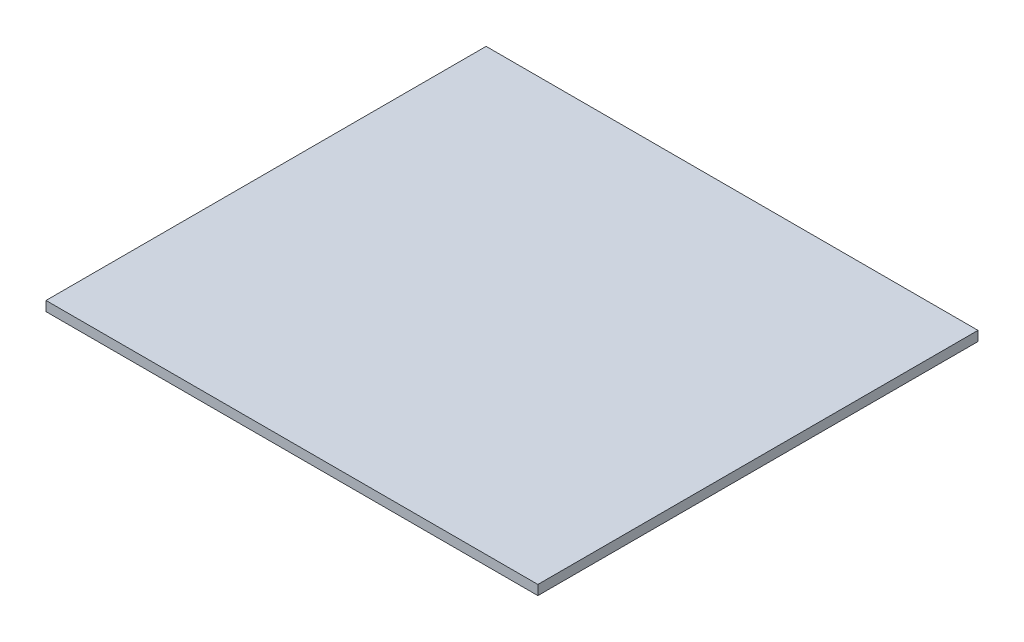
ISO-10303-21;
HEADER;
FILE_DESCRIPTION(('STEP AP214'),'2;1');
FILE_NAME('part.step','',(''),(''),'','','');
FILE_SCHEMA(('AUTOMOTIVE_DESIGN { 1 0 10303 214 1 1 1 1 }'));
ENDSEC;
DATA;
#1=APPLICATION_CONTEXT('core data for automotive mechanical design processes');
#2=APPLICATION_PROTOCOL_DEFINITION('international standard','automotive_design',2000,#1);
#3=PRODUCT_CONTEXT('',#1,'mechanical');
#4=PRODUCT('Part','Part','',(#3));
#5=PRODUCT_RELATED_PRODUCT_CATEGORY('part','',(#4));
#6=PRODUCT_DEFINITION_FORMATION('','',#4);
#7=PRODUCT_DEFINITION_CONTEXT('part definition',#1,'design');
#8=PRODUCT_DEFINITION('design','',#6,#7);
#9=PRODUCT_DEFINITION_SHAPE('','',#8);
#10=(LENGTH_UNIT() NAMED_UNIT(*) SI_UNIT(.MILLI.,.METRE.));
#11=(NAMED_UNIT(*) PLANE_ANGLE_UNIT() SI_UNIT($,.RADIAN.));
#12=(NAMED_UNIT(*) SI_UNIT($,.STERADIAN.) SOLID_ANGLE_UNIT());
#13=UNCERTAINTY_MEASURE_WITH_UNIT(LENGTH_MEASURE(1.E-05),#10,'distance_accuracy_value','');
#14=(GEOMETRIC_REPRESENTATION_CONTEXT(3) GLOBAL_UNCERTAINTY_ASSIGNED_CONTEXT((#13)) GLOBAL_UNIT_ASSIGNED_CONTEXT((#10,
#11,#12)) REPRESENTATION_CONTEXT('',''));
#15=CARTESIAN_POINT('',(0.,0.,0.));
#16=DIRECTION('',(0.,0.,1.));
#17=DIRECTION('',(1.,0.,0.));
#18=AXIS2_PLACEMENT_3D('',#15,#16,#17);
#19=CARTESIAN_POINT('',(0.,6.,0.));
#20=DIRECTION('',(1.,0.,0.));
#21=DIRECTION('',(0.,0.,-1.));
#22=AXIS2_PLACEMENT_3D('',#19,#20,#21);
#23=PLANE('',#22);
#24=DIRECTION('',(0.,0.,1.));
#25=VECTOR('',#24,1.);
#26=CARTESIAN_POINT('',(0.,0.,0.));
#27=LINE('',#26,#25);
#28=CARTESIAN_POINT('',(0.,0.,-272.));
#29=VERTEX_POINT('',#28);
#30=CARTESIAN_POINT('',(0.,0.,0.));
#31=VERTEX_POINT('',#30);
#32=EDGE_CURVE('E98',#29,#31,#27,.T.);
#33=ORIENTED_EDGE('',*,*,#32,.T.);
#34=DIRECTION('',(0.,-1.,0.));
#35=VECTOR('',#34,1.);
#36=CARTESIAN_POINT('',(0.,6.,0.));
#37=LINE('',#36,#35);
#38=CARTESIAN_POINT('',(0.,6.,0.));
#39=VERTEX_POINT('',#38);
#40=EDGE_CURVE('E11',#39,#31,#37,.T.);
#41=ORIENTED_EDGE('',*,*,#40,.F.);
#42=DIRECTION('',(0.,0.,1.));
#43=VECTOR('',#42,1.);
#44=CARTESIAN_POINT('',(0.,6.,0.));
#45=LINE('',#44,#43);
#46=CARTESIAN_POINT('',(0.,6.,-272.));
#47=VERTEX_POINT('',#46);
#48=EDGE_CURVE('E86',#47,#39,#45,.T.);
#49=ORIENTED_EDGE('',*,*,#48,.F.);
#50=DIRECTION('',(0.,-1.,0.));
#51=VECTOR('',#50,1.);
#52=CARTESIAN_POINT('',(0.,6.,-272.));
#53=LINE('',#52,#51);
#54=EDGE_CURVE('E94',#47,#29,#53,.T.);
#55=ORIENTED_EDGE('',*,*,#54,.T.);
#56=EDGE_LOOP('',(#33,#41,#49,#55));
#57=FACE_BOUND('',#56,.T.);
#58=ADVANCED_FACE('F35',(#57),#23,.F.);
#59=CARTESIAN_POINT('',(0.,6.,0.));
#60=DIRECTION('',(0.,0.,-1.));
#61=DIRECTION('',(-1.,0.,0.));
#62=AXIS2_PLACEMENT_3D('',#59,#60,#61);
#63=PLANE('',#62);
#64=DIRECTION('',(1.,0.,0.));
#65=VECTOR('',#64,1.);
#66=CARTESIAN_POINT('',(0.,0.,0.));
#67=LINE('',#66,#65);
#68=CARTESIAN_POINT('',(304.,0.,0.));
#69=VERTEX_POINT('',#68);
#70=EDGE_CURVE('E90',#31,#69,#67,.T.);
#71=ORIENTED_EDGE('',*,*,#70,.T.);
#72=DIRECTION('',(0.,-1.,0.));
#73=VECTOR('',#72,1.);
#74=CARTESIAN_POINT('',(304.,6.,0.));
#75=LINE('',#74,#73);
#76=CARTESIAN_POINT('',(304.,6.,0.));
#77=VERTEX_POINT('',#76);
#78=EDGE_CURVE('E43',#77,#69,#75,.T.);
#79=ORIENTED_EDGE('',*,*,#78,.F.);
#80=DIRECTION('',(1.,0.,0.));
#81=VECTOR('',#80,1.);
#82=CARTESIAN_POINT('',(0.,6.,0.));
#83=LINE('',#82,#81);
#84=EDGE_CURVE('E81',#39,#77,#83,.T.);
#85=ORIENTED_EDGE('',*,*,#84,.F.);
#86=ORIENTED_EDGE('',*,*,#40,.T.);
#87=EDGE_LOOP('',(#71,#79,#85,#86));
#88=FACE_BOUND('',#87,.T.);
#89=ADVANCED_FACE('F89',(#88),#63,.F.);
#90=CARTESIAN_POINT('',(304.,6.,0.));
#91=DIRECTION('',(-1.,0.,0.));
#92=DIRECTION('',(0.,0.,1.));
#93=AXIS2_PLACEMENT_3D('',#90,#91,#92);
#94=PLANE('',#93);
#95=DIRECTION('',(0.,0.,-1.));
#96=VECTOR('',#95,1.);
#97=CARTESIAN_POINT('',(304.,0.,0.));
#98=LINE('',#97,#96);
#99=CARTESIAN_POINT('',(304.,0.,-272.));
#100=VERTEX_POINT('',#99);
#101=EDGE_CURVE('E68',#69,#100,#98,.T.);
#102=ORIENTED_EDGE('',*,*,#101,.T.);
#103=DIRECTION('',(0.,-1.,0.));
#104=VECTOR('',#103,1.);
#105=CARTESIAN_POINT('',(304.,6.,-272.));
#106=LINE('',#105,#104);
#107=CARTESIAN_POINT('',(304.,6.,-272.));
#108=VERTEX_POINT('',#107);
#109=EDGE_CURVE('E91',#108,#100,#106,.T.);
#110=ORIENTED_EDGE('',*,*,#109,.F.);
#111=DIRECTION('',(0.,0.,-1.));
#112=VECTOR('',#111,1.);
#113=CARTESIAN_POINT('',(304.,6.,0.));
#114=LINE('',#113,#112);
#115=EDGE_CURVE('E84',#77,#108,#114,.T.);
#116=ORIENTED_EDGE('',*,*,#115,.F.);
#117=ORIENTED_EDGE('',*,*,#78,.T.);
#118=EDGE_LOOP('',(#102,#110,#116,#117));
#119=FACE_BOUND('',#118,.T.);
#120=ADVANCED_FACE('F92',(#119),#94,.F.);
#121=CARTESIAN_POINT('',(0.,6.,-272.));
#122=DIRECTION('',(0.,0.,1.));
#123=DIRECTION('',(1.,0.,0.));
#124=AXIS2_PLACEMENT_3D('',#121,#122,#123);
#125=PLANE('',#124);
#126=DIRECTION('',(-1.,0.,0.));
#127=VECTOR('',#126,1.);
#128=CARTESIAN_POINT('',(0.,0.,-272.));
#129=LINE('',#128,#127);
#130=EDGE_CURVE('E74',#100,#29,#129,.T.);
#131=ORIENTED_EDGE('',*,*,#130,.T.);
#132=ORIENTED_EDGE('',*,*,#54,.F.);
#133=DIRECTION('',(-1.,0.,0.));
#134=VECTOR('',#133,1.);
#135=CARTESIAN_POINT('',(0.,6.,-272.));
#136=LINE('',#135,#134);
#137=EDGE_CURVE('E51',#108,#47,#136,.T.);
#138=ORIENTED_EDGE('',*,*,#137,.F.);
#139=ORIENTED_EDGE('',*,*,#109,.T.);
#140=EDGE_LOOP('',(#131,#132,#138,#139));
#141=FACE_BOUND('',#140,.T.);
#142=ADVANCED_FACE('F105',(#141),#125,.F.);
#143=CARTESIAN_POINT('',(0.,6.,0.));
#144=DIRECTION('',(0.,-1.,0.));
#145=DIRECTION('',(0.,0.,-1.));
#146=AXIS2_PLACEMENT_3D('',#143,#144,#145);
#147=PLANE('',#146);
#148=ORIENTED_EDGE('',*,*,#48,.T.);
#149=ORIENTED_EDGE('',*,*,#84,.T.);
#150=ORIENTED_EDGE('',*,*,#115,.T.);
#151=ORIENTED_EDGE('',*,*,#137,.T.);
#152=EDGE_LOOP('',(#148,#149,#150,#151));
#153=FACE_BOUND('',#152,.T.);
#154=ADVANCED_FACE('F82',(#153),#147,.F.);
#155=CARTESIAN_POINT('',(0.,0.,0.));
#156=DIRECTION('',(0.,-1.,0.));
#157=DIRECTION('',(0.,0.,-1.));
#158=AXIS2_PLACEMENT_3D('',#155,#156,#157);
#159=PLANE('',#158);
#160=ORIENTED_EDGE('',*,*,#32,.F.);
#161=ORIENTED_EDGE('',*,*,#130,.F.);
#162=ORIENTED_EDGE('',*,*,#101,.F.);
#163=ORIENTED_EDGE('',*,*,#70,.F.);
#164=EDGE_LOOP('',(#160,#161,#162,#163));
#165=FACE_BOUND('',#164,.T.);
#166=ADVANCED_FACE('F108',(#165),#159,.T.);
#167=CLOSED_SHELL('',(#58,#89,#120,#142,#154,#166));
#168=MANIFOLD_SOLID_BREP('B2',#167);
#169=ADVANCED_BREP_SHAPE_REPRESENTATION('',(#18,#168),#14);
#170=SHAPE_DEFINITION_REPRESENTATION(#9,#169);
ENDSEC;
END-ISO-10303-21;
